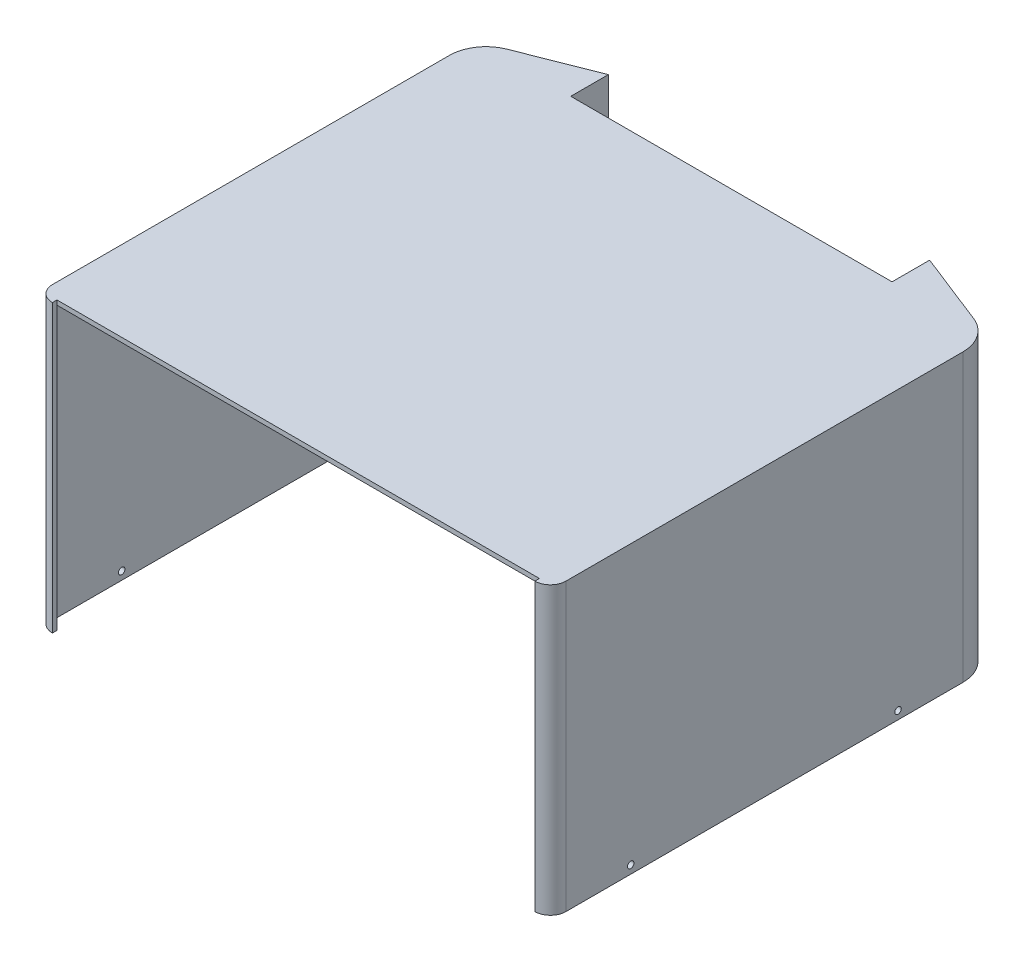
ISO-10303-21;
HEADER;
FILE_DESCRIPTION(('STEP AP214'),'2;1');
FILE_NAME('part.step','',(''),(''),'','','');
FILE_SCHEMA(('AUTOMOTIVE_DESIGN { 1 0 10303 214 1 1 1 1 }'));
ENDSEC;
DATA;
#1=APPLICATION_CONTEXT('core data for automotive mechanical design processes');
#2=APPLICATION_PROTOCOL_DEFINITION('international standard','automotive_design',2000,#1);
#3=PRODUCT_CONTEXT('',#1,'mechanical');
#4=PRODUCT('Part','Part','',(#3));
#5=PRODUCT_RELATED_PRODUCT_CATEGORY('part','',(#4));
#6=PRODUCT_DEFINITION_FORMATION('','',#4);
#7=PRODUCT_DEFINITION_CONTEXT('part definition',#1,'design');
#8=PRODUCT_DEFINITION('design','',#6,#7);
#9=PRODUCT_DEFINITION_SHAPE('','',#8);
#10=(LENGTH_UNIT() NAMED_UNIT(*) SI_UNIT(.MILLI.,.METRE.));
#11=(NAMED_UNIT(*) PLANE_ANGLE_UNIT() SI_UNIT($,.RADIAN.));
#12=(NAMED_UNIT(*) SI_UNIT($,.STERADIAN.) SOLID_ANGLE_UNIT());
#13=UNCERTAINTY_MEASURE_WITH_UNIT(LENGTH_MEASURE(1.E-05),#10,'distance_accuracy_value','');
#14=(GEOMETRIC_REPRESENTATION_CONTEXT(3) GLOBAL_UNCERTAINTY_ASSIGNED_CONTEXT((#13)) GLOBAL_UNIT_ASSIGNED_CONTEXT((#10,
#11,#12)) REPRESENTATION_CONTEXT('',''));
#15=CARTESIAN_POINT('',(0.,0.,0.));
#16=DIRECTION('',(0.,0.,1.));
#17=DIRECTION('',(1.,0.,0.));
#18=AXIS2_PLACEMENT_3D('',#15,#16,#17);
#19=CARTESIAN_POINT('',(-50.0594055574218,82.,0.));
#20=DIRECTION('',(-1.,0.,0.));
#21=DIRECTION('',(0.,0.,1.));
#22=AXIS2_PLACEMENT_3D('',#19,#20,#21);
#23=PLANE('',#22);
#24=DIRECTION('',(0.,0.,1.));
#25=VECTOR('',#24,1.);
#26=CARTESIAN_POINT('',(-50.0594055574218,81.6600000000001,-61.0605386585292));
#27=LINE('',#26,#25);
#28=CARTESIAN_POINT('',(-50.0594055574218,81.6600000000001,-61.0605386585292));
#29=VERTEX_POINT('',#28);
#30=CARTESIAN_POINT('',(-50.0594055574218,81.6600000000001,-59.6605386585292));
#31=VERTEX_POINT('',#30);
#32=EDGE_CURVE('E417',#29,#31,#27,.T.);
#33=ORIENTED_EDGE('',*,*,#32,.T.);
#34=DIRECTION('',(0.,-1.,0.));
#35=VECTOR('',#34,1.);
#36=CARTESIAN_POINT('',(-50.0594055574218,96.9,-59.6605386585272));
#37=LINE('',#36,#35);
#38=CARTESIAN_POINT('',(-50.0594055574218,0.,-59.6605386585272));
#39=VERTEX_POINT('',#38);
#40=EDGE_CURVE('E46',#31,#39,#37,.T.);
#41=ORIENTED_EDGE('',*,*,#40,.T.);
#42=DIRECTION('',(0.,0.,-1.));
#43=VECTOR('',#42,1.);
#44=CARTESIAN_POINT('',(-50.0594055574218,0.,0.));
#45=LINE('',#44,#43);
#46=CARTESIAN_POINT('',(-50.0594055574218,0.,-72.6605386585272));
#47=VERTEX_POINT('',#46);
#48=EDGE_CURVE('E333',#39,#47,#45,.T.);
#49=ORIENTED_EDGE('',*,*,#48,.T.);
#50=DIRECTION('',(0.,-1.,0.));
#51=VECTOR('',#50,1.);
#52=CARTESIAN_POINT('',(-50.0594055574218,82.,-72.6605386585272));
#53=LINE('',#52,#51);
#54=CARTESIAN_POINT('',(-50.0594055574218,88.4,-72.6605386585272));
#55=VERTEX_POINT('',#54);
#56=EDGE_CURVE('E244',#55,#47,#53,.T.);
#57=ORIENTED_EDGE('',*,*,#56,.F.);
#58=DIRECTION('',(0.,0.,-1.));
#59=VECTOR('',#58,1.);
#60=CARTESIAN_POINT('',(-50.0594055574218,88.4,0.));
#61=LINE('',#60,#59);
#62=CARTESIAN_POINT('',(-50.0594055574218,88.4,-61.0605386585292));
#63=VERTEX_POINT('',#62);
#64=EDGE_CURVE('E226',#63,#55,#61,.T.);
#65=ORIENTED_EDGE('',*,*,#64,.F.);
#66=DIRECTION('',(0.,-1.,0.));
#67=VECTOR('',#66,1.);
#68=CARTESIAN_POINT('',(-50.0594055574218,0.,-61.0605386585292));
#69=LINE('',#68,#67);
#70=EDGE_CURVE('E233',#63,#29,#69,.T.);
#71=ORIENTED_EDGE('',*,*,#70,.T.);
#72=EDGE_LOOP('',(#33,#41,#49,#57,#65,#71));
#73=FACE_BOUND('',#72,.T.);
#74=ADVANCED_FACE('F42',(#73),#23,.F.);
#75=CARTESIAN_POINT('',(49.1720519476544,88.4,0.));
#76=DIRECTION('',(1.,0.,0.));
#77=DIRECTION('',(0.,0.,-1.));
#78=AXIS2_PLACEMENT_3D('',#75,#76,#77);
#79=PLANE('',#78);
#80=DIRECTION('',(0.,0.,1.));
#81=VECTOR('',#80,1.);
#82=CARTESIAN_POINT('',(49.1720519476541,81.66,-61.0605386585272));
#83=LINE('',#82,#81);
#84=CARTESIAN_POINT('',(49.1720519476541,81.66,-61.0605386585272));
#85=VERTEX_POINT('',#84);
#86=CARTESIAN_POINT('',(49.1720519476544,81.66,-59.6605386585272));
#87=VERTEX_POINT('',#86);
#88=EDGE_CURVE('E444',#85,#87,#83,.T.);
#89=ORIENTED_EDGE('',*,*,#88,.F.);
#90=DIRECTION('',(0.,-1.,0.));
#91=VECTOR('',#90,1.);
#92=CARTESIAN_POINT('',(49.1720519476509,-1.92367756039792E-12,-61.0605386585272));
#93=LINE('',#92,#91);
#94=CARTESIAN_POINT('',(49.1720519476544,88.4,-61.0605386585272));
#95=VERTEX_POINT('',#94);
#96=EDGE_CURVE('E232',#95,#85,#93,.T.);
#97=ORIENTED_EDGE('',*,*,#96,.F.);
#98=DIRECTION('',(0.,0.,1.));
#99=VECTOR('',#98,1.);
#100=CARTESIAN_POINT('',(49.1720519476544,88.4,0.));
#101=LINE('',#100,#99);
#102=CARTESIAN_POINT('',(49.1720519476544,88.4,-72.6605386585272));
#103=VERTEX_POINT('',#102);
#104=EDGE_CURVE('E229',#103,#95,#101,.T.);
#105=ORIENTED_EDGE('',*,*,#104,.F.);
#106=DIRECTION('',(0.,-1.,0.));
#107=VECTOR('',#106,1.);
#108=CARTESIAN_POINT('',(49.1720519476544,88.4,-72.6605386585272));
#109=LINE('',#108,#107);
#110=CARTESIAN_POINT('',(49.1720519476544,0.,-72.6605386585272));
#111=VERTEX_POINT('',#110);
#112=EDGE_CURVE('E281',#103,#111,#109,.T.);
#113=ORIENTED_EDGE('',*,*,#112,.T.);
#114=DIRECTION('',(0.,0.,-1.));
#115=VECTOR('',#114,1.);
#116=CARTESIAN_POINT('',(49.1720519476544,0.,0.));
#117=LINE('',#116,#115);
#118=CARTESIAN_POINT('',(49.1720519476544,0.,-59.6605386585272));
#119=VERTEX_POINT('',#118);
#120=EDGE_CURVE('E519',#119,#111,#117,.T.);
#121=ORIENTED_EDGE('',*,*,#120,.F.);
#122=DIRECTION('',(0.,-1.,0.));
#123=VECTOR('',#122,1.);
#124=CARTESIAN_POINT('',(49.1720519476544,82.,-59.6605386585272));
#125=LINE('',#124,#123);
#126=EDGE_CURVE('E541',#87,#119,#125,.T.);
#127=ORIENTED_EDGE('',*,*,#126,.F.);
#128=EDGE_LOOP('',(#89,#97,#105,#113,#121,#127));
#129=FACE_BOUND('',#128,.T.);
#130=ADVANCED_FACE('F484',(#129),#79,.F.);
#131=CARTESIAN_POINT('',(0.,87.,0.));
#132=DIRECTION('',(0.,1.,0.));
#133=DIRECTION('',(0.,0.,1.));
#134=AXIS2_PLACEMENT_3D('',#131,#132,#133);
#135=PLANE('',#134);
#136=DIRECTION('',(1.,0.,0.));
#137=VECTOR('',#136,1.);
#138=CARTESIAN_POINT('',(-51.4594055574218,87.,-59.6605386585272));
#139=LINE('',#138,#137);
#140=CARTESIAN_POINT('',(-51.4594055574218,87.,-59.6605386585272));
#141=VERTEX_POINT('',#140);
#142=CARTESIAN_POINT('',(50.5720519476544,87.,-59.6605386585272));
#143=VERTEX_POINT('',#142);
#144=EDGE_CURVE('E301',#141,#143,#139,.T.);
#145=ORIENTED_EDGE('',*,*,#144,.T.);
#146=DIRECTION('',(0.,0.,-1.));
#147=VECTOR('',#146,1.);
#148=CARTESIAN_POINT('',(50.5720519476544,87.,-59.6605386585272));
#149=LINE('',#148,#147);
#150=CARTESIAN_POINT('',(50.5720519476544,87.,-70.6049959841991));
#151=VERTEX_POINT('',#150);
#152=EDGE_CURVE('E443',#143,#151,#149,.T.);
#153=ORIENTED_EDGE('',*,*,#152,.T.);
#154=DIRECTION('',(0.930522484488547,0.,0.366234768777162));
#155=VECTOR('',#154,1.);
#156=CARTESIAN_POINT('',(50.5720519476544,87.,-70.6049959841991));
#157=LINE('',#156,#155);
#158=CARTESIAN_POINT('',(71.1186708828879,87.,-62.5182636802143));
#159=VERTEX_POINT('',#158);
#160=EDGE_CURVE('E494',#151,#159,#157,.T.);
#161=ORIENTED_EDGE('',*,*,#160,.T.);
#162=CARTESIAN_POINT('',(67.4563231951163,87.,-53.2130388353289));
#163=DIRECTION('',(0.,-1.,0.));
#164=DIRECTION('',(0.,0.,1.));
#165=AXIS2_PLACEMENT_3D('',#162,#163,#164);
#166=CIRCLE('',#165,9.99999999999996);
#167=CARTESIAN_POINT('',(77.4563231951162,87.,-53.2130388353289));
#168=VERTEX_POINT('',#167);
#169=EDGE_CURVE('E497',#159,#168,#166,.T.);
#170=ORIENTED_EDGE('',*,*,#169,.T.);
#171=DIRECTION('',(0.,0.,1.));
#172=VECTOR('',#171,1.);
#173=CARTESIAN_POINT('',(77.4563231951162,87.,-53.2130388353289));
#174=LINE('',#173,#172);
#175=CARTESIAN_POINT('',(77.4563231951163,87.,69.3394613414728));
#176=VERTEX_POINT('',#175);
#177=EDGE_CURVE('E441',#168,#176,#174,.T.);
#178=ORIENTED_EDGE('',*,*,#177,.T.);
#179=CARTESIAN_POINT('',(74.0563231951163,87.,69.3394613414728));
#180=DIRECTION('',(0.,-1.,0.));
#181=DIRECTION('',(0.,0.,1.));
#182=AXIS2_PLACEMENT_3D('',#179,#180,#181);
#183=CIRCLE('',#182,3.39999999999999);
#184=CARTESIAN_POINT('',(74.0563231951163,87.,72.7394613414728));
#185=VERTEX_POINT('',#184);
#186=EDGE_CURVE('E438',#176,#185,#183,.T.);
#187=ORIENTED_EDGE('',*,*,#186,.T.);
#188=DIRECTION('',(-1.,0.,0.));
#189=VECTOR('',#188,1.);
#190=CARTESIAN_POINT('',(0.,87.,72.7394613414728));
#191=LINE('',#190,#189);
#192=CARTESIAN_POINT('',(-74.9436768048837,87.,72.7394613414728));
#193=VERTEX_POINT('',#192);
#194=EDGE_CURVE('E247',#185,#193,#191,.T.);
#195=ORIENTED_EDGE('',*,*,#194,.T.);
#196=CARTESIAN_POINT('',(-74.9436768048837,87.,69.3394613414728));
#197=DIRECTION('',(0.,-1.,0.));
#198=DIRECTION('',(0.,0.,1.));
#199=AXIS2_PLACEMENT_3D('',#196,#197,#198);
#200=CIRCLE('',#199,3.4);
#201=CARTESIAN_POINT('',(-78.3436768048837,87.,69.3394613414728));
#202=VERTEX_POINT('',#201);
#203=EDGE_CURVE('E303',#193,#202,#200,.T.);
#204=ORIENTED_EDGE('',*,*,#203,.T.);
#205=DIRECTION('',(0.,0.,-1.));
#206=VECTOR('',#205,1.);
#207=CARTESIAN_POINT('',(-78.3436768048837,87.,69.3394613414728));
#208=LINE('',#207,#206);
#209=CARTESIAN_POINT('',(-78.3436768048837,87.,-53.2130388353288));
#210=VERTEX_POINT('',#209);
#211=EDGE_CURVE('E306',#202,#210,#208,.T.);
#212=ORIENTED_EDGE('',*,*,#211,.T.);
#213=CARTESIAN_POINT('',(-68.3436768048837,87.,-53.2130388353289));
#214=DIRECTION('',(0.,-1.,0.));
#215=DIRECTION('',(0.,0.,1.));
#216=AXIS2_PLACEMENT_3D('',#213,#214,#215);
#217=CIRCLE('',#216,10.);
#218=CARTESIAN_POINT('',(-72.0060244926553,87.,-62.5182636802143));
#219=VERTEX_POINT('',#218);
#220=EDGE_CURVE('E309',#210,#219,#217,.T.);
#221=ORIENTED_EDGE('',*,*,#220,.T.);
#222=DIRECTION('',(0.930522484488548,0.,-0.36623476877716));
#223=VECTOR('',#222,1.);
#224=CARTESIAN_POINT('',(-72.0060244926553,87.,-62.5182636802143));
#225=LINE('',#224,#223);
#226=CARTESIAN_POINT('',(-51.4594055574218,87.,-70.6049959841991));
#227=VERTEX_POINT('',#226);
#228=EDGE_CURVE('E312',#219,#227,#225,.T.);
#229=ORIENTED_EDGE('',*,*,#228,.T.);
#230=DIRECTION('',(0.,0.,1.));
#231=VECTOR('',#230,1.);
#232=CARTESIAN_POINT('',(-51.4594055574218,87.,-70.6049959841991));
#233=LINE('',#232,#231);
#234=EDGE_CURVE('E298',#227,#141,#233,.T.);
#235=ORIENTED_EDGE('',*,*,#234,.T.);
#236=EDGE_LOOP('',(#145,#153,#161,#170,#178,#187,#195,#204,#212,#221,#229,#235));
#237=FACE_BOUND('',#236,.T.);
#238=ADVANCED_FACE('F434',(#237),#135,.F.);
#239=CARTESIAN_POINT('',(0.,0.,0.));
#240=DIRECTION('',(0.,1.,0.));
#241=DIRECTION('',(0.,0.,1.));
#242=AXIS2_PLACEMENT_3D('',#239,#240,#241);
#243=PLANE('',#242);
#244=CARTESIAN_POINT('',(-74.9436768048837,0.,69.3394613414728));
#245=DIRECTION('',(0.,1.,0.));
#246=DIRECTION('',(0.,0.,1.));
#247=AXIS2_PLACEMENT_3D('',#244,#245,#246);
#248=CIRCLE('',#247,3.4);
#249=CARTESIAN_POINT('',(-78.3436768048837,0.,69.3394613414728));
#250=VERTEX_POINT('',#249);
#251=CARTESIAN_POINT('',(-74.9436768048837,0.,72.7394613414728));
#252=VERTEX_POINT('',#251);
#253=EDGE_CURVE('E315',#250,#252,#248,.T.);
#254=ORIENTED_EDGE('',*,*,#253,.T.);
#255=DIRECTION('',(0.,0.,1.));
#256=VECTOR('',#255,1.);
#257=CARTESIAN_POINT('',(-74.9436768048837,0.,72.6394613414728));
#258=LINE('',#257,#256);
#259=CARTESIAN_POINT('',(-74.9436768048837,0.,74.1394613414728));
#260=VERTEX_POINT('',#259);
#261=EDGE_CURVE('E67',#252,#260,#258,.T.);
#262=ORIENTED_EDGE('',*,*,#261,.T.);
#263=CARTESIAN_POINT('',(-74.9436768048837,0.,69.3394613414728));
#264=DIRECTION('',(0.,1.,0.));
#265=DIRECTION('',(0.,0.,1.));
#266=AXIS2_PLACEMENT_3D('',#263,#264,#265);
#267=CIRCLE('',#266,4.8);
#268=CARTESIAN_POINT('',(-79.7436768048837,0.,69.3394613414728));
#269=VERTEX_POINT('',#268);
#270=EDGE_CURVE('E338',#269,#260,#267,.T.);
#271=ORIENTED_EDGE('',*,*,#270,.F.);
#272=DIRECTION('',(0.,0.,1.));
#273=VECTOR('',#272,1.);
#274=CARTESIAN_POINT('',(-79.7436768048837,0.,0.));
#275=LINE('',#274,#273);
#276=CARTESIAN_POINT('',(-79.7436768048837,0.,-53.2130388353288));
#277=VERTEX_POINT('',#276);
#278=EDGE_CURVE('E335',#277,#269,#275,.T.);
#279=ORIENTED_EDGE('',*,*,#278,.F.);
#280=CARTESIAN_POINT('',(-68.3436768048837,0.,-53.2130388353289));
#281=DIRECTION('',(0.,1.,0.));
#282=DIRECTION('',(0.,0.,1.));
#283=AXIS2_PLACEMENT_3D('',#280,#281,#282);
#284=CIRCLE('',#283,11.4);
#285=CARTESIAN_POINT('',(-72.5187531689433,0.,-63.8209951584983));
#286=VERTEX_POINT('',#285);
#287=EDGE_CURVE('E348',#277,#286,#284,.F.);
#288=ORIENTED_EDGE('',*,*,#287,.T.);
#289=DIRECTION('',(0.930522484488547,0.,-0.366234768777162));
#290=VECTOR('',#289,1.);
#291=CARTESIAN_POINT('',(-31.4763254590337,0.,-79.9744619182552));
#292=LINE('',#291,#290);
#293=EDGE_CURVE('E351',#286,#47,#292,.T.);
#294=ORIENTED_EDGE('',*,*,#293,.T.);
#295=ORIENTED_EDGE('',*,*,#48,.F.);
#296=DIRECTION('',(-1.,0.,0.));
#297=VECTOR('',#296,1.);
#298=CARTESIAN_POINT('',(0.,0.,-59.6605386585272));
#299=LINE('',#298,#297);
#300=CARTESIAN_POINT('',(-51.4594055574218,0.,-59.6605386585272));
#301=VERTEX_POINT('',#300);
#302=EDGE_CURVE('E354',#39,#301,#299,.T.);
#303=ORIENTED_EDGE('',*,*,#302,.T.);
#304=DIRECTION('',(0.,0.,-1.));
#305=VECTOR('',#304,1.);
#306=CARTESIAN_POINT('',(-51.4594055574218,0.,0.));
#307=LINE('',#306,#305);
#308=CARTESIAN_POINT('',(-51.4594055574218,0.,-70.6049959841991));
#309=VERTEX_POINT('',#308);
#310=EDGE_CURVE('E358',#301,#309,#307,.T.);
#311=ORIENTED_EDGE('',*,*,#310,.T.);
#312=DIRECTION('',(0.930522484488547,0.,-0.366234768777162));
#313=VECTOR('',#312,1.);
#314=CARTESIAN_POINT('',(-30.9635967827457,0.,-78.6717304399712));
#315=LINE('',#314,#313);
#316=CARTESIAN_POINT('',(-72.0060244926553,0.,-62.5182636802143));
#317=VERTEX_POINT('',#316);
#318=EDGE_CURVE('E326',#317,#309,#315,.T.);
#319=ORIENTED_EDGE('',*,*,#318,.F.);
#320=CARTESIAN_POINT('',(-68.3436768048837,0.,-53.2130388353289));
#321=DIRECTION('',(0.,1.,0.));
#322=DIRECTION('',(0.,0.,1.));
#323=AXIS2_PLACEMENT_3D('',#320,#321,#322);
#324=CIRCLE('',#323,9.99999999999998);
#325=CARTESIAN_POINT('',(-78.3436768048837,0.,-53.2130388353288));
#326=VERTEX_POINT('',#325);
#327=EDGE_CURVE('E323',#326,#317,#324,.F.);
#328=ORIENTED_EDGE('',*,*,#327,.F.);
#329=DIRECTION('',(0.,0.,1.));
#330=VECTOR('',#329,1.);
#331=CARTESIAN_POINT('',(-78.3436768048837,0.,0.));
#332=LINE('',#331,#330);
#333=EDGE_CURVE('E319',#326,#250,#332,.T.);
#334=ORIENTED_EDGE('',*,*,#333,.T.);
#335=EDGE_LOOP('',(#254,#262,#271,#279,#288,#294,#295,#303,#311,#319,#328,#334));
#336=FACE_BOUND('',#335,.T.);
#337=ADVANCED_FACE('F44',(#336),#243,.F.);
#338=CARTESIAN_POINT('',(-74.9436768048837,82.,69.3394613414728));
#339=DIRECTION('',(0.,-1.,0.));
#340=DIRECTION('',(0.,0.,-1.));
#341=AXIS2_PLACEMENT_3D('',#338,#339,#340);
#342=CYLINDRICAL_SURFACE('',#341,3.4);
#343=DIRECTION('',(0.,-1.,0.));
#344=VECTOR('',#343,1.);
#345=CARTESIAN_POINT('',(-78.3436768048837,82.,69.3394613414728));
#346=LINE('',#345,#344);
#347=EDGE_CURVE('E318',#202,#250,#346,.T.);
#348=ORIENTED_EDGE('',*,*,#347,.F.);
#349=ORIENTED_EDGE('',*,*,#203,.F.);
#350=DIRECTION('',(0.,-1.,0.));
#351=VECTOR('',#350,1.);
#352=CARTESIAN_POINT('',(-74.9436768048837,82.,72.7394613414728));
#353=LINE('',#352,#351);
#354=EDGE_CURVE('E316',#193,#252,#353,.T.);
#355=ORIENTED_EDGE('',*,*,#354,.T.);
#356=ORIENTED_EDGE('',*,*,#253,.F.);
#357=EDGE_LOOP('',(#348,#349,#355,#356));
#358=FACE_BOUND('',#357,.T.);
#359=ADVANCED_FACE('F398',(#358),#342,.F.);
#360=CARTESIAN_POINT('',(-78.3436768048837,82.,0.));
#361=DIRECTION('',(1.,0.,0.));
#362=DIRECTION('',(0.,0.,-1.));
#363=AXIS2_PLACEMENT_3D('',#360,#361,#362);
#364=PLANE('',#363);
#365=CARTESIAN_POINT('',(-78.3436768048837,2.5,-33.2130388353288));
#366=DIRECTION('',(1.,0.,0.));
#367=DIRECTION('',(0.,0.,-1.));
#368=AXIS2_PLACEMENT_3D('',#365,#366,#367);
#369=CIRCLE('',#368,0.999999999999998);
#370=CARTESIAN_POINT('',(-78.3436768048837,2.5,-34.2130388353288));
#371=VERTEX_POINT('',#370);
#372=EDGE_CURVE('E51',#371,#371,#369,.T.);
#373=ORIENTED_EDGE('',*,*,#372,.F.);
#374=EDGE_LOOP('',(#373));
#375=FACE_BOUND('',#374,.T.);
#376=CARTESIAN_POINT('',(-78.3436768048837,2.5,49.3394613414728));
#377=DIRECTION('',(1.,0.,0.));
#378=DIRECTION('',(0.,0.,-1.));
#379=AXIS2_PLACEMENT_3D('',#376,#377,#378);
#380=CIRCLE('',#379,0.999999999999998);
#381=CARTESIAN_POINT('',(-78.3436768048837,2.5,48.3394613414728));
#382=VERTEX_POINT('',#381);
#383=EDGE_CURVE('E344',#382,#382,#380,.T.);
#384=ORIENTED_EDGE('',*,*,#383,.F.);
#385=EDGE_LOOP('',(#384));
#386=FACE_BOUND('',#385,.T.);
#387=DIRECTION('',(0.,-1.,0.));
#388=VECTOR('',#387,1.);
#389=CARTESIAN_POINT('',(-78.3436768048837,82.,-53.2130388353288));
#390=LINE('',#389,#388);
#391=EDGE_CURVE('E321',#210,#326,#390,.T.);
#392=ORIENTED_EDGE('',*,*,#391,.F.);
#393=ORIENTED_EDGE('',*,*,#211,.F.);
#394=ORIENTED_EDGE('',*,*,#347,.T.);
#395=ORIENTED_EDGE('',*,*,#333,.F.);
#396=EDGE_LOOP('',(#392,#393,#394,#395));
#397=FACE_BOUND('',#396,.T.);
#398=ADVANCED_FACE('F432',(#375,#386,#397),#364,.T.);
#399=CARTESIAN_POINT('',(-68.3436768048837,82.,-53.2130388353289));
#400=DIRECTION('',(0.,-1.,0.));
#401=DIRECTION('',(0.,0.,-1.));
#402=AXIS2_PLACEMENT_3D('',#399,#400,#401);
#403=CYLINDRICAL_SURFACE('',#402,9.99999999999998);
#404=DIRECTION('',(0.,-1.,0.));
#405=VECTOR('',#404,1.);
#406=CARTESIAN_POINT('',(-72.0060244926553,82.,-62.5182636802143));
#407=LINE('',#406,#405);
#408=EDGE_CURVE('E324',#219,#317,#407,.T.);
#409=ORIENTED_EDGE('',*,*,#408,.F.);
#410=ORIENTED_EDGE('',*,*,#220,.F.);
#411=ORIENTED_EDGE('',*,*,#391,.T.);
#412=ORIENTED_EDGE('',*,*,#327,.T.);
#413=EDGE_LOOP('',(#409,#410,#411,#412));
#414=FACE_BOUND('',#413,.T.);
#415=ADVANCED_FACE('F430',(#414),#403,.F.);
#416=CARTESIAN_POINT('',(-30.9635967827457,82.,-78.6717304399712));
#417=DIRECTION('',(-0.366234768777162,0.,-0.930522484488547));
#418=DIRECTION('',(-0.930522484488547,0.,0.366234768777162));
#419=AXIS2_PLACEMENT_3D('',#416,#417,#418);
#420=PLANE('',#419);
#421=DIRECTION('',(0.,-1.,0.));
#422=VECTOR('',#421,1.);
#423=CARTESIAN_POINT('',(-51.4594055574218,82.,-70.6049959841991));
#424=LINE('',#423,#422);
#425=EDGE_CURVE('E327',#227,#309,#424,.T.);
#426=ORIENTED_EDGE('',*,*,#425,.F.);
#427=ORIENTED_EDGE('',*,*,#228,.F.);
#428=ORIENTED_EDGE('',*,*,#408,.T.);
#429=ORIENTED_EDGE('',*,*,#318,.T.);
#430=EDGE_LOOP('',(#426,#427,#428,#429));
#431=FACE_BOUND('',#430,.T.);
#432=ADVANCED_FACE('F427',(#431),#420,.F.);
#433=CARTESIAN_POINT('',(-51.4594055574218,82.,0.));
#434=DIRECTION('',(-1.,0.,0.));
#435=DIRECTION('',(0.,0.,1.));
#436=AXIS2_PLACEMENT_3D('',#433,#434,#435);
#437=PLANE('',#436);
#438=DIRECTION('',(0.,-1.,0.));
#439=VECTOR('',#438,1.);
#440=CARTESIAN_POINT('',(-51.4594055574218,82.,-59.6605386585272));
#441=LINE('',#440,#439);
#442=EDGE_CURVE('E329',#141,#301,#441,.T.);
#443=ORIENTED_EDGE('',*,*,#442,.F.);
#444=ORIENTED_EDGE('',*,*,#234,.F.);
#445=ORIENTED_EDGE('',*,*,#425,.T.);
#446=ORIENTED_EDGE('',*,*,#310,.F.);
#447=EDGE_LOOP('',(#443,#444,#445,#446));
#448=FACE_BOUND('',#447,.T.);
#449=ADVANCED_FACE('F423',(#448),#437,.T.);
#450=CARTESIAN_POINT('',(0.,82.,-59.6605386585272));
#451=DIRECTION('',(0.,0.,1.));
#452=DIRECTION('',(1.,0.,0.));
#453=AXIS2_PLACEMENT_3D('',#450,#451,#452);
#454=PLANE('',#453);
#455=ORIENTED_EDGE('',*,*,#302,.F.);
#456=ORIENTED_EDGE('',*,*,#40,.F.);
#457=DIRECTION('',(-1.,0.,0.));
#458=VECTOR('',#457,1.);
#459=CARTESIAN_POINT('',(1.21471754603014E-12,81.66,-59.6605386585282));
#460=LINE('',#459,#458);
#461=EDGE_CURVE('E58',#87,#31,#460,.T.);
#462=ORIENTED_EDGE('',*,*,#461,.F.);
#463=ORIENTED_EDGE('',*,*,#126,.T.);
#464=DIRECTION('',(1.,0.,0.));
#465=VECTOR('',#464,1.);
#466=CARTESIAN_POINT('',(0.,0.,-59.6605386585272));
#467=LINE('',#466,#465);
#468=CARTESIAN_POINT('',(50.5720519476544,0.,-59.6605386585272));
#469=VERTEX_POINT('',#468);
#470=EDGE_CURVE('E521',#119,#469,#467,.T.);
#471=ORIENTED_EDGE('',*,*,#470,.T.);
#472=DIRECTION('',(0.,-1.,0.));
#473=VECTOR('',#472,1.);
#474=CARTESIAN_POINT('',(50.5720519476544,82.,-59.6605386585272));
#475=LINE('',#474,#473);
#476=EDGE_CURVE('E539',#143,#469,#475,.T.);
#477=ORIENTED_EDGE('',*,*,#476,.F.);
#478=ORIENTED_EDGE('',*,*,#144,.F.);
#479=ORIENTED_EDGE('',*,*,#442,.T.);
#480=EDGE_LOOP('',(#455,#456,#462,#463,#471,#477,#478,#479));
#481=FACE_BOUND('',#480,.T.);
#482=ADVANCED_FACE('F418',(#481),#454,.T.);
#483=CARTESIAN_POINT('',(-31.4763254590337,82.,-79.9744619182552));
#484=DIRECTION('',(-0.366234768777162,0.,-0.930522484488547));
#485=DIRECTION('',(-0.930522484488547,0.,0.366234768777162));
#486=AXIS2_PLACEMENT_3D('',#483,#484,#485);
#487=PLANE('',#486);
#488=ORIENTED_EDGE('',*,*,#293,.F.);
#489=DIRECTION('',(0.,-1.,0.));
#490=VECTOR('',#489,1.);
#491=CARTESIAN_POINT('',(-72.5187531689433,82.,-63.8209951584983));
#492=LINE('',#491,#490);
#493=CARTESIAN_POINT('',(-72.5187531689434,88.4,-63.8209951584983));
#494=VERTEX_POINT('',#493);
#495=EDGE_CURVE('E332',#494,#286,#492,.T.);
#496=ORIENTED_EDGE('',*,*,#495,.F.);
#497=DIRECTION('',(-0.930522484488547,0.,0.366234768777162));
#498=VECTOR('',#497,1.);
#499=CARTESIAN_POINT('',(-31.4763254590337,88.4,-79.9744619182552));
#500=LINE('',#499,#498);
#501=EDGE_CURVE('E246',#55,#494,#500,.T.);
#502=ORIENTED_EDGE('',*,*,#501,.F.);
#503=ORIENTED_EDGE('',*,*,#56,.T.);
#504=EDGE_LOOP('',(#488,#496,#502,#503));
#505=FACE_BOUND('',#504,.T.);
#506=ADVANCED_FACE('F416',(#505),#487,.T.);
#507=CARTESIAN_POINT('',(-68.3436768048837,82.,-53.2130388353289));
#508=DIRECTION('',(0.,-1.,0.));
#509=DIRECTION('',(0.,0.,-1.));
#510=AXIS2_PLACEMENT_3D('',#507,#508,#509);
#511=CYLINDRICAL_SURFACE('',#510,11.4);
#512=ORIENTED_EDGE('',*,*,#287,.F.);
#513=DIRECTION('',(0.,-1.,0.));
#514=VECTOR('',#513,1.);
#515=CARTESIAN_POINT('',(-79.7436768048837,82.,-53.2130388353288));
#516=LINE('',#515,#514);
#517=CARTESIAN_POINT('',(-79.7436768048837,88.4,-53.2130388353288));
#518=VERTEX_POINT('',#517);
#519=EDGE_CURVE('E336',#518,#277,#516,.T.);
#520=ORIENTED_EDGE('',*,*,#519,.F.);
#521=CARTESIAN_POINT('',(-68.3436768048837,88.4,-53.2130388353289));
#522=DIRECTION('',(0.,1.,0.));
#523=DIRECTION('',(0.,0.,1.));
#524=AXIS2_PLACEMENT_3D('',#521,#522,#523);
#525=CIRCLE('',#524,11.4);
#526=EDGE_CURVE('E249',#494,#518,#525,.T.);
#527=ORIENTED_EDGE('',*,*,#526,.F.);
#528=ORIENTED_EDGE('',*,*,#495,.T.);
#529=EDGE_LOOP('',(#512,#520,#527,#528));
#530=FACE_BOUND('',#529,.T.);
#531=ADVANCED_FACE('F384',(#530),#511,.T.);
#532=CARTESIAN_POINT('',(-79.7436768048837,82.,0.));
#533=DIRECTION('',(1.,0.,0.));
#534=DIRECTION('',(0.,0.,-1.));
#535=AXIS2_PLACEMENT_3D('',#532,#533,#534);
#536=PLANE('',#535);
#537=CARTESIAN_POINT('',(-79.7436768048837,2.5,-33.2130388353288));
#538=DIRECTION('',(-1.,0.,0.));
#539=DIRECTION('',(0.,0.,1.));
#540=AXIS2_PLACEMENT_3D('',#537,#538,#539);
#541=CIRCLE('',#540,0.999999999999998);
#542=CARTESIAN_POINT('',(-79.7436768048837,2.5,-32.2130388353288));
#543=VERTEX_POINT('',#542);
#544=EDGE_CURVE('E11',#543,#543,#541,.T.);
#545=ORIENTED_EDGE('',*,*,#544,.F.);
#546=EDGE_LOOP('',(#545));
#547=FACE_BOUND('',#546,.T.);
#548=CARTESIAN_POINT('',(-79.7436768048837,2.5,49.3394613414728));
#549=DIRECTION('',(-1.,0.,0.));
#550=DIRECTION('',(0.,0.,1.));
#551=AXIS2_PLACEMENT_3D('',#548,#549,#550);
#552=CIRCLE('',#551,0.999999999999998);
#553=CARTESIAN_POINT('',(-79.7436768048837,2.5,50.3394613414728));
#554=VERTEX_POINT('',#553);
#555=EDGE_CURVE('E372',#554,#554,#552,.T.);
#556=ORIENTED_EDGE('',*,*,#555,.F.);
#557=EDGE_LOOP('',(#556));
#558=FACE_BOUND('',#557,.T.);
#559=ORIENTED_EDGE('',*,*,#278,.T.);
#560=DIRECTION('',(0.,-1.,0.));
#561=VECTOR('',#560,1.);
#562=CARTESIAN_POINT('',(-79.7436768048837,82.,69.3394613414728));
#563=LINE('',#562,#561);
#564=CARTESIAN_POINT('',(-79.7436768048837,88.4,69.3394613414728));
#565=VERTEX_POINT('',#564);
#566=EDGE_CURVE('E339',#565,#269,#563,.T.);
#567=ORIENTED_EDGE('',*,*,#566,.F.);
#568=DIRECTION('',(0.,0.,1.));
#569=VECTOR('',#568,1.);
#570=CARTESIAN_POINT('',(-79.7436768048837,88.4,0.));
#571=LINE('',#570,#569);
#572=EDGE_CURVE('E260',#518,#565,#571,.T.);
#573=ORIENTED_EDGE('',*,*,#572,.F.);
#574=ORIENTED_EDGE('',*,*,#519,.T.);
#575=EDGE_LOOP('',(#559,#567,#573,#574));
#576=FACE_BOUND('',#575,.T.);
#577=ADVANCED_FACE('F380',(#547,#558,#576),#536,.F.);
#578=CARTESIAN_POINT('',(-74.9436768048837,82.,69.3394613414728));
#579=DIRECTION('',(0.,-1.,0.));
#580=DIRECTION('',(0.,0.,-1.));
#581=AXIS2_PLACEMENT_3D('',#578,#579,#580);
#582=CYLINDRICAL_SURFACE('',#581,4.8);
#583=ORIENTED_EDGE('',*,*,#270,.T.);
#584=DIRECTION('',(0.,-1.,0.));
#585=VECTOR('',#584,1.);
#586=CARTESIAN_POINT('',(-74.9436768048837,82.,74.1394613414728));
#587=LINE('',#586,#585);
#588=CARTESIAN_POINT('',(-74.9436768048837,88.4,74.1394613414728));
#589=VERTEX_POINT('',#588);
#590=EDGE_CURVE('E342',#589,#260,#587,.T.);
#591=ORIENTED_EDGE('',*,*,#590,.F.);
#592=CARTESIAN_POINT('',(-74.9436768048837,88.4,69.3394613414728));
#593=DIRECTION('',(0.,1.,0.));
#594=DIRECTION('',(0.,0.,1.));
#595=AXIS2_PLACEMENT_3D('',#592,#593,#594);
#596=CIRCLE('',#595,4.80000000000001);
#597=EDGE_CURVE('E263',#565,#589,#596,.T.);
#598=ORIENTED_EDGE('',*,*,#597,.F.);
#599=ORIENTED_EDGE('',*,*,#566,.T.);
#600=EDGE_LOOP('',(#583,#591,#598,#599));
#601=FACE_BOUND('',#600,.T.);
#602=ADVANCED_FACE('F383',(#601),#582,.T.);
#603=CARTESIAN_POINT('',(-74.9436768048837,82.,72.6394613414728));
#604=DIRECTION('',(-1.,0.,0.));
#605=DIRECTION('',(0.,0.,1.));
#606=AXIS2_PLACEMENT_3D('',#603,#604,#605);
#607=PLANE('',#606);
#608=ORIENTED_EDGE('',*,*,#354,.F.);
#609=DIRECTION('',(0.,-1.,0.));
#610=VECTOR('',#609,1.);
#611=CARTESIAN_POINT('',(-74.9436768048837,88.4,72.7394613414728));
#612=LINE('',#611,#610);
#613=CARTESIAN_POINT('',(-74.9436768048837,88.4,72.7394613414728));
#614=VERTEX_POINT('',#613);
#615=EDGE_CURVE('E295',#614,#193,#612,.T.);
#616=ORIENTED_EDGE('',*,*,#615,.F.);
#617=DIRECTION('',(0.,0.,-1.));
#618=VECTOR('',#617,1.);
#619=CARTESIAN_POINT('',(-74.9436768048837,88.4,0.));
#620=LINE('',#619,#618);
#621=EDGE_CURVE('E266',#589,#614,#620,.T.);
#622=ORIENTED_EDGE('',*,*,#621,.F.);
#623=ORIENTED_EDGE('',*,*,#590,.T.);
#624=ORIENTED_EDGE('',*,*,#261,.F.);
#625=EDGE_LOOP('',(#608,#616,#622,#623,#624));
#626=FACE_BOUND('',#625,.T.);
#627=ADVANCED_FACE('F402',(#626),#607,.F.);
#628=CARTESIAN_POINT('',(163.256323195116,2.5,49.3394613414728));
#629=DIRECTION('',(-1.,0.,0.));
#630=DIRECTION('',(0.,0.,1.));
#631=AXIS2_PLACEMENT_3D('',#628,#629,#630);
#632=CYLINDRICAL_SURFACE('',#631,0.999999999999998);
#633=ORIENTED_EDGE('',*,*,#383,.T.);
#634=EDGE_LOOP('',(#633));
#635=FACE_BOUND('',#634,.T.);
#636=ORIENTED_EDGE('',*,*,#555,.T.);
#637=EDGE_LOOP('',(#636));
#638=FACE_BOUND('',#637,.T.);
#639=ADVANCED_FACE('F378',(#635,#638),#632,.F.);
#640=CARTESIAN_POINT('',(163.256323195116,2.5,-33.2130388353288));
#641=DIRECTION('',(-1.,0.,0.));
#642=DIRECTION('',(0.,0.,1.));
#643=AXIS2_PLACEMENT_3D('',#640,#641,#642);
#644=CYLINDRICAL_SURFACE('',#643,0.999999999999998);
#645=ORIENTED_EDGE('',*,*,#372,.T.);
#646=EDGE_LOOP('',(#645));
#647=FACE_BOUND('',#646,.T.);
#648=ORIENTED_EDGE('',*,*,#544,.T.);
#649=EDGE_LOOP('',(#648));
#650=FACE_BOUND('',#649,.T.);
#651=ADVANCED_FACE('F576',(#647,#650),#644,.F.);
#652=CARTESIAN_POINT('',(0.,88.4,72.7394613414728));
#653=DIRECTION('',(0.,0.,1.));
#654=DIRECTION('',(1.,0.,0.));
#655=AXIS2_PLACEMENT_3D('',#652,#653,#654);
#656=PLANE('',#655);
#657=ORIENTED_EDGE('',*,*,#194,.F.);
#658=DIRECTION('',(0.,-1.,0.));
#659=VECTOR('',#658,1.);
#660=CARTESIAN_POINT('',(74.0563231951163,88.4,72.7394613414728));
#661=LINE('',#660,#659);
#662=CARTESIAN_POINT('',(74.0563231951163,88.4,72.7394613414728));
#663=VERTEX_POINT('',#662);
#664=EDGE_CURVE('E292',#663,#185,#661,.T.);
#665=ORIENTED_EDGE('',*,*,#664,.F.);
#666=DIRECTION('',(-1.,0.,0.));
#667=VECTOR('',#666,1.);
#668=CARTESIAN_POINT('',(0.,88.4,72.7394613414728));
#669=LINE('',#668,#667);
#670=EDGE_CURVE('E268',#663,#614,#669,.T.);
#671=ORIENTED_EDGE('',*,*,#670,.T.);
#672=ORIENTED_EDGE('',*,*,#615,.T.);
#673=EDGE_LOOP('',(#657,#665,#671,#672));
#674=FACE_BOUND('',#673,.T.);
#675=ADVANCED_FACE('F407',(#674),#656,.T.);
#676=CARTESIAN_POINT('',(74.0563231951163,88.4,0.));
#677=DIRECTION('',(1.,0.,0.));
#678=DIRECTION('',(0.,0.,-1.));
#679=AXIS2_PLACEMENT_3D('',#676,#677,#678);
#680=PLANE('',#679);
#681=ORIENTED_EDGE('',*,*,#664,.T.);
#682=DIRECTION('',(0.,-1.,0.));
#683=VECTOR('',#682,1.);
#684=CARTESIAN_POINT('',(74.0563231951163,82.,72.7394613414728));
#685=LINE('',#684,#683);
#686=CARTESIAN_POINT('',(74.0563231951163,0.,72.7394613414728));
#687=VERTEX_POINT('',#686);
#688=EDGE_CURVE('E449',#185,#687,#685,.T.);
#689=ORIENTED_EDGE('',*,*,#688,.T.);
#690=DIRECTION('',(0.,0.,1.));
#691=VECTOR('',#690,1.);
#692=CARTESIAN_POINT('',(74.0563231951163,0.,72.6394613414728));
#693=LINE('',#692,#691);
#694=CARTESIAN_POINT('',(74.0563231951163,0.,74.1394613414728));
#695=VERTEX_POINT('',#694);
#696=EDGE_CURVE('E452',#687,#695,#693,.T.);
#697=ORIENTED_EDGE('',*,*,#696,.T.);
#698=DIRECTION('',(0.,-1.,0.));
#699=VECTOR('',#698,1.);
#700=CARTESIAN_POINT('',(74.0563231951163,88.4,74.1394613414728));
#701=LINE('',#700,#699);
#702=CARTESIAN_POINT('',(74.0563231951163,88.4,74.1394613414728));
#703=VERTEX_POINT('',#702);
#704=EDGE_CURVE('E290',#703,#695,#701,.T.);
#705=ORIENTED_EDGE('',*,*,#704,.F.);
#706=DIRECTION('',(0.,0.,1.));
#707=VECTOR('',#706,1.);
#708=CARTESIAN_POINT('',(74.0563231951163,88.4,0.));
#709=LINE('',#708,#707);
#710=EDGE_CURVE('E271',#663,#703,#709,.T.);
#711=ORIENTED_EDGE('',*,*,#710,.F.);
#712=EDGE_LOOP('',(#681,#689,#697,#705,#711));
#713=FACE_BOUND('',#712,.T.);
#714=ADVANCED_FACE('F447',(#713),#680,.F.);
#715=CARTESIAN_POINT('',(74.0563231951163,88.4,69.3394613414728));
#716=DIRECTION('',(0.,-1.,0.));
#717=DIRECTION('',(0.,0.,-1.));
#718=AXIS2_PLACEMENT_3D('',#715,#716,#717);
#719=CYLINDRICAL_SURFACE('',#718,4.8);
#720=ORIENTED_EDGE('',*,*,#704,.T.);
#721=CARTESIAN_POINT('',(74.0563231951163,0.,69.3394613414728));
#722=DIRECTION('',(0.,1.,0.));
#723=DIRECTION('',(0.,0.,1.));
#724=AXIS2_PLACEMENT_3D('',#721,#722,#723);
#725=CIRCLE('',#724,4.8);
#726=CARTESIAN_POINT('',(78.8563231951163,0.,69.3394613414728));
#727=VERTEX_POINT('',#726);
#728=EDGE_CURVE('E514',#727,#695,#725,.F.);
#729=ORIENTED_EDGE('',*,*,#728,.F.);
#730=DIRECTION('',(0.,-1.,0.));
#731=VECTOR('',#730,1.);
#732=CARTESIAN_POINT('',(78.8563231951163,88.4,69.3394613414728));
#733=LINE('',#732,#731);
#734=CARTESIAN_POINT('',(78.8563231951163,88.4,69.3394613414728));
#735=VERTEX_POINT('',#734);
#736=EDGE_CURVE('E288',#735,#727,#733,.T.);
#737=ORIENTED_EDGE('',*,*,#736,.F.);
#738=CARTESIAN_POINT('',(74.0563231951163,88.4,69.3394613414728));
#739=DIRECTION('',(0.,1.,0.));
#740=DIRECTION('',(0.,0.,1.));
#741=AXIS2_PLACEMENT_3D('',#738,#739,#740);
#742=CIRCLE('',#741,4.8);
#743=EDGE_CURVE('E273',#703,#735,#742,.T.);
#744=ORIENTED_EDGE('',*,*,#743,.F.);
#745=EDGE_LOOP('',(#720,#729,#737,#744));
#746=FACE_BOUND('',#745,.T.);
#747=ADVANCED_FACE('F457',(#746),#719,.T.);
#748=CARTESIAN_POINT('',(78.8563231951163,88.4,0.));
#749=DIRECTION('',(-1.,0.,0.));
#750=DIRECTION('',(0.,0.,1.));
#751=AXIS2_PLACEMENT_3D('',#748,#749,#750);
#752=PLANE('',#751);
#753=ORIENTED_EDGE('',*,*,#736,.T.);
#754=DIRECTION('',(0.,0.,1.));
#755=VECTOR('',#754,1.);
#756=CARTESIAN_POINT('',(78.8563231951163,0.,0.));
#757=LINE('',#756,#755);
#758=CARTESIAN_POINT('',(78.8563231951163,0.,-53.2130388353288));
#759=VERTEX_POINT('',#758);
#760=EDGE_CURVE('E467',#759,#727,#757,.T.);
#761=ORIENTED_EDGE('',*,*,#760,.F.);
#762=DIRECTION('',(0.,-1.,0.));
#763=VECTOR('',#762,1.);
#764=CARTESIAN_POINT('',(78.8563231951163,88.4,-53.2130388353288));
#765=LINE('',#764,#763);
#766=CARTESIAN_POINT('',(78.8563231951163,88.4,-53.2130388353288));
#767=VERTEX_POINT('',#766);
#768=EDGE_CURVE('E286',#767,#759,#765,.T.);
#769=ORIENTED_EDGE('',*,*,#768,.F.);
#770=DIRECTION('',(0.,0.,-1.));
#771=VECTOR('',#770,1.);
#772=CARTESIAN_POINT('',(78.8563231951163,88.4,0.));
#773=LINE('',#772,#771);
#774=EDGE_CURVE('E275',#735,#767,#773,.T.);
#775=ORIENTED_EDGE('',*,*,#774,.F.);
#776=EDGE_LOOP('',(#753,#761,#769,#775));
#777=FACE_BOUND('',#776,.T.);
#778=CARTESIAN_POINT('',(78.8563231951163,2.5,-33.2130388353288));
#779=DIRECTION('',(1.,0.,0.));
#780=DIRECTION('',(0.,0.,-1.));
#781=AXIS2_PLACEMENT_3D('',#778,#779,#780);
#782=CIRCLE('',#781,0.999999999999998);
#783=CARTESIAN_POINT('',(78.8563231951163,2.5,-34.2130388353288));
#784=VERTEX_POINT('',#783);
#785=EDGE_CURVE('E255',#784,#784,#782,.T.);
#786=ORIENTED_EDGE('',*,*,#785,.F.);
#787=EDGE_LOOP('',(#786));
#788=FACE_BOUND('',#787,.T.);
#789=CARTESIAN_POINT('',(78.8563231951163,2.5,49.3394613414728));
#790=DIRECTION('',(1.,0.,0.));
#791=DIRECTION('',(0.,0.,-1.));
#792=AXIS2_PLACEMENT_3D('',#789,#790,#791);
#793=CIRCLE('',#792,0.999999999999998);
#794=CARTESIAN_POINT('',(78.8563231951163,2.5,48.3394613414728));
#795=VERTEX_POINT('',#794);
#796=EDGE_CURVE('E500',#795,#795,#793,.T.);
#797=ORIENTED_EDGE('',*,*,#796,.F.);
#798=EDGE_LOOP('',(#797));
#799=FACE_BOUND('',#798,.T.);
#800=ADVANCED_FACE('F464',(#777,#788,#799),#752,.F.);
#801=CARTESIAN_POINT('',(67.4563231951163,88.4,-53.2130388353289));
#802=DIRECTION('',(0.,-1.,0.));
#803=DIRECTION('',(0.,0.,-1.));
#804=AXIS2_PLACEMENT_3D('',#801,#802,#803);
#805=CYLINDRICAL_SURFACE('',#804,11.4);
#806=ORIENTED_EDGE('',*,*,#768,.T.);
#807=CARTESIAN_POINT('',(67.4563231951163,0.,-53.2130388353289));
#808=DIRECTION('',(0.,1.,0.));
#809=DIRECTION('',(0.,0.,1.));
#810=AXIS2_PLACEMENT_3D('',#807,#808,#809);
#811=CIRCLE('',#810,11.4);
#812=CARTESIAN_POINT('',(71.6313995591759,0.,-63.8209951584983));
#813=VERTEX_POINT('',#812);
#814=EDGE_CURVE('E473',#759,#813,#811,.T.);
#815=ORIENTED_EDGE('',*,*,#814,.T.);
#816=DIRECTION('',(0.,-1.,0.));
#817=VECTOR('',#816,1.);
#818=CARTESIAN_POINT('',(71.6313995591759,88.4,-63.8209951584983));
#819=LINE('',#818,#817);
#820=CARTESIAN_POINT('',(71.6313995591759,88.4,-63.8209951584983));
#821=VERTEX_POINT('',#820);
#822=EDGE_CURVE('E284',#821,#813,#819,.T.);
#823=ORIENTED_EDGE('',*,*,#822,.F.);
#824=CARTESIAN_POINT('',(67.4563231951163,88.4,-53.2130388353289));
#825=DIRECTION('',(0.,1.,0.));
#826=DIRECTION('',(0.,0.,1.));
#827=AXIS2_PLACEMENT_3D('',#824,#825,#826);
#828=CIRCLE('',#827,11.4);
#829=EDGE_CURVE('E277',#767,#821,#828,.T.);
#830=ORIENTED_EDGE('',*,*,#829,.F.);
#831=EDGE_LOOP('',(#806,#815,#823,#830));
#832=FACE_BOUND('',#831,.T.);
#833=ADVANCED_FACE('F471',(#832),#805,.T.);
#834=CARTESIAN_POINT('',(31.357306577597,88.4,-79.6720609593698));
#835=DIRECTION('',(-0.366234768777161,0.,0.930522484488548));
#836=DIRECTION('',(0.930522484488548,0.,0.366234768777161));
#837=AXIS2_PLACEMENT_3D('',#834,#835,#836);
#838=PLANE('',#837);
#839=ORIENTED_EDGE('',*,*,#822,.T.);
#840=DIRECTION('',(-0.930522484488547,0.,-0.366234768777162));
#841=VECTOR('',#840,1.);
#842=CARTESIAN_POINT('',(31.3573065775971,0.,-79.6720609593698));
#843=LINE('',#842,#841);
#844=EDGE_CURVE('E479',#813,#111,#843,.T.);
#845=ORIENTED_EDGE('',*,*,#844,.T.);
#846=ORIENTED_EDGE('',*,*,#112,.F.);
#847=DIRECTION('',(-0.930522484488548,0.,-0.366234768777161));
#848=VECTOR('',#847,1.);
#849=CARTESIAN_POINT('',(31.357306577597,88.4,-79.6720609593698));
#850=LINE('',#849,#848);
#851=EDGE_CURVE('E279',#821,#103,#850,.T.);
#852=ORIENTED_EDGE('',*,*,#851,.F.);
#853=EDGE_LOOP('',(#839,#845,#846,#852));
#854=FACE_BOUND('',#853,.T.);
#855=ADVANCED_FACE('F478',(#854),#838,.F.);
#856=CARTESIAN_POINT('',(0.,88.4,0.));
#857=DIRECTION('',(0.,1.,0.));
#858=DIRECTION('',(0.,0.,1.));
#859=AXIS2_PLACEMENT_3D('',#856,#857,#858);
#860=PLANE('',#859);
#861=DIRECTION('',(1.,0.,0.));
#862=VECTOR('',#861,1.);
#863=CARTESIAN_POINT('',(1.20821200583998E-12,88.4,-61.0605386585282));
#864=LINE('',#863,#862);
#865=EDGE_CURVE('E221',#63,#95,#864,.T.);
#866=ORIENTED_EDGE('',*,*,#865,.F.);
#867=ORIENTED_EDGE('',*,*,#64,.T.);
#868=ORIENTED_EDGE('',*,*,#501,.T.);
#869=ORIENTED_EDGE('',*,*,#526,.T.);
#870=ORIENTED_EDGE('',*,*,#572,.T.);
#871=ORIENTED_EDGE('',*,*,#597,.T.);
#872=ORIENTED_EDGE('',*,*,#621,.T.);
#873=ORIENTED_EDGE('',*,*,#670,.F.);
#874=ORIENTED_EDGE('',*,*,#710,.T.);
#875=ORIENTED_EDGE('',*,*,#743,.T.);
#876=ORIENTED_EDGE('',*,*,#774,.T.);
#877=ORIENTED_EDGE('',*,*,#829,.T.);
#878=ORIENTED_EDGE('',*,*,#851,.T.);
#879=ORIENTED_EDGE('',*,*,#104,.T.);
#880=EDGE_LOOP('',(#866,#867,#868,#869,#870,#871,#872,#873,#874,#875,#876,#877,#878,#879));
#881=FACE_BOUND('',#880,.T.);
#882=ADVANCED_FACE('F223',(#881),#860,.T.);
#883=CARTESIAN_POINT('',(163.256323195116,2.5,49.3394613414728));
#884=DIRECTION('',(-1.,0.,0.));
#885=DIRECTION('',(0.,0.,1.));
#886=AXIS2_PLACEMENT_3D('',#883,#884,#885);
#887=CYLINDRICAL_SURFACE('',#886,0.999999999999998);
#888=ORIENTED_EDGE('',*,*,#796,.T.);
#889=EDGE_LOOP('',(#888));
#890=FACE_BOUND('',#889,.T.);
#891=CARTESIAN_POINT('',(77.4563231951163,2.5,49.3394613414728));
#892=DIRECTION('',(1.,0.,0.));
#893=DIRECTION('',(0.,0.,-1.));
#894=AXIS2_PLACEMENT_3D('',#891,#892,#893);
#895=CIRCLE('',#894,0.999999999999998);
#896=CARTESIAN_POINT('',(77.4563231951163,2.5,48.3394613414728));
#897=VERTEX_POINT('',#896);
#898=EDGE_CURVE('E501',#897,#897,#895,.T.);
#899=ORIENTED_EDGE('',*,*,#898,.F.);
#900=EDGE_LOOP('',(#899));
#901=FACE_BOUND('',#900,.T.);
#902=ADVANCED_FACE('F547',(#890,#901),#887,.F.);
#903=CARTESIAN_POINT('',(163.256323195116,2.5,-33.2130388353288));
#904=DIRECTION('',(-1.,0.,0.));
#905=DIRECTION('',(0.,0.,1.));
#906=AXIS2_PLACEMENT_3D('',#903,#904,#905);
#907=CYLINDRICAL_SURFACE('',#906,0.999999999999998);
#908=ORIENTED_EDGE('',*,*,#785,.T.);
#909=EDGE_LOOP('',(#908));
#910=FACE_BOUND('',#909,.T.);
#911=CARTESIAN_POINT('',(77.4563231951163,2.5,-33.2130388353288));
#912=DIRECTION('',(1.,0.,0.));
#913=DIRECTION('',(0.,0.,-1.));
#914=AXIS2_PLACEMENT_3D('',#911,#912,#913);
#915=CIRCLE('',#914,0.999999999999998);
#916=CARTESIAN_POINT('',(77.4563231951163,2.5,-34.2130388353288));
#917=VERTEX_POINT('',#916);
#918=EDGE_CURVE('E504',#917,#917,#915,.T.);
#919=ORIENTED_EDGE('',*,*,#918,.F.);
#920=EDGE_LOOP('',(#919));
#921=FACE_BOUND('',#920,.T.);
#922=ADVANCED_FACE('F692',(#910,#921),#907,.F.);
#923=CARTESIAN_POINT('',(0.,0.,0.));
#924=DIRECTION('',(0.,1.,0.));
#925=DIRECTION('',(0.,0.,1.));
#926=AXIS2_PLACEMENT_3D('',#923,#924,#925);
#927=PLANE('',#926);
#928=ORIENTED_EDGE('',*,*,#728,.T.);
#929=ORIENTED_EDGE('',*,*,#696,.F.);
#930=CARTESIAN_POINT('',(74.0563231951163,0.,69.3394613414728));
#931=DIRECTION('',(0.,1.,0.));
#932=DIRECTION('',(0.,0.,1.));
#933=AXIS2_PLACEMENT_3D('',#930,#931,#932);
#934=CIRCLE('',#933,3.39999999999999);
#935=CARTESIAN_POINT('',(77.4563231951163,0.,69.3394613414728));
#936=VERTEX_POINT('',#935);
#937=EDGE_CURVE('E511',#936,#687,#934,.F.);
#938=ORIENTED_EDGE('',*,*,#937,.F.);
#939=DIRECTION('',(0.,0.,1.));
#940=VECTOR('',#939,1.);
#941=CARTESIAN_POINT('',(77.4563231951163,0.,0.));
#942=LINE('',#941,#940);
#943=CARTESIAN_POINT('',(77.4563231951163,0.,-53.2130388353288));
#944=VERTEX_POINT('',#943);
#945=EDGE_CURVE('E508',#944,#936,#942,.T.);
#946=ORIENTED_EDGE('',*,*,#945,.F.);
#947=CARTESIAN_POINT('',(67.4563231951163,0.,-53.2130388353289));
#948=DIRECTION('',(0.,1.,0.));
#949=DIRECTION('',(0.,0.,1.));
#950=AXIS2_PLACEMENT_3D('',#947,#948,#949);
#951=CIRCLE('',#950,9.99999999999998);
#952=CARTESIAN_POINT('',(71.1186708828879,0.,-62.5182636802143));
#953=VERTEX_POINT('',#952);
#954=EDGE_CURVE('E530',#944,#953,#951,.T.);
#955=ORIENTED_EDGE('',*,*,#954,.T.);
#956=DIRECTION('',(-0.930522484488547,0.,-0.366234768777162));
#957=VECTOR('',#956,1.);
#958=CARTESIAN_POINT('',(30.8445779013092,0.,-78.3693294810858));
#959=LINE('',#958,#957);
#960=CARTESIAN_POINT('',(50.5720519476544,0.,-70.6049959841991));
#961=VERTEX_POINT('',#960);
#962=EDGE_CURVE('E527',#953,#961,#959,.T.);
#963=ORIENTED_EDGE('',*,*,#962,.T.);
#964=DIRECTION('',(0.,0.,-1.));
#965=VECTOR('',#964,1.);
#966=CARTESIAN_POINT('',(50.5720519476544,0.,0.));
#967=LINE('',#966,#965);
#968=EDGE_CURVE('E524',#469,#961,#967,.T.);
#969=ORIENTED_EDGE('',*,*,#968,.F.);
#970=ORIENTED_EDGE('',*,*,#470,.F.);
#971=ORIENTED_EDGE('',*,*,#120,.T.);
#972=ORIENTED_EDGE('',*,*,#844,.F.);
#973=ORIENTED_EDGE('',*,*,#814,.F.);
#974=ORIENTED_EDGE('',*,*,#760,.T.);
#975=EDGE_LOOP('',(#928,#929,#938,#946,#955,#963,#969,#970,#971,#972,#973,#974));
#976=FACE_BOUND('',#975,.T.);
#977=ADVANCED_FACE('F701',(#976),#927,.F.);
#978=CARTESIAN_POINT('',(50.5720519476544,82.,0.));
#979=DIRECTION('',(-1.,0.,0.));
#980=DIRECTION('',(0.,0.,1.));
#981=AXIS2_PLACEMENT_3D('',#978,#979,#980);
#982=PLANE('',#981);
#983=DIRECTION('',(0.,-1.,0.));
#984=VECTOR('',#983,1.);
#985=CARTESIAN_POINT('',(50.5720519476544,82.,-70.6049959841991));
#986=LINE('',#985,#984);
#987=EDGE_CURVE('E537',#151,#961,#986,.T.);
#988=ORIENTED_EDGE('',*,*,#987,.F.);
#989=ORIENTED_EDGE('',*,*,#152,.F.);
#990=ORIENTED_EDGE('',*,*,#476,.T.);
#991=ORIENTED_EDGE('',*,*,#968,.T.);
#992=EDGE_LOOP('',(#988,#989,#990,#991));
#993=FACE_BOUND('',#992,.T.);
#994=ADVANCED_FACE('F711',(#993),#982,.F.);
#995=CARTESIAN_POINT('',(30.8445779013092,82.,-78.3693294810858));
#996=DIRECTION('',(-0.366234768777162,0.,0.930522484488547));
#997=DIRECTION('',(0.930522484488547,0.,0.366234768777162));
#998=AXIS2_PLACEMENT_3D('',#995,#996,#997);
#999=PLANE('',#998);
#1000=DIRECTION('',(0.,-1.,0.));
#1001=VECTOR('',#1000,1.);
#1002=CARTESIAN_POINT('',(71.1186708828879,82.,-62.5182636802143));
#1003=LINE('',#1002,#1001);
#1004=EDGE_CURVE('E535',#159,#953,#1003,.T.);
#1005=ORIENTED_EDGE('',*,*,#1004,.F.);
#1006=ORIENTED_EDGE('',*,*,#160,.F.);
#1007=ORIENTED_EDGE('',*,*,#987,.T.);
#1008=ORIENTED_EDGE('',*,*,#962,.F.);
#1009=EDGE_LOOP('',(#1005,#1006,#1007,#1008));
#1010=FACE_BOUND('',#1009,.T.);
#1011=ADVANCED_FACE('F721',(#1010),#999,.T.);
#1012=CARTESIAN_POINT('',(67.4563231951163,82.,-53.2130388353289));
#1013=DIRECTION('',(0.,-1.,0.));
#1014=DIRECTION('',(0.,0.,-1.));
#1015=AXIS2_PLACEMENT_3D('',#1012,#1013,#1014);
#1016=CYLINDRICAL_SURFACE('',#1015,9.99999999999998);
#1017=DIRECTION('',(0.,-1.,0.));
#1018=VECTOR('',#1017,1.);
#1019=CARTESIAN_POINT('',(77.4563231951163,82.,-53.2130388353288));
#1020=LINE('',#1019,#1018);
#1021=EDGE_CURVE('E533',#168,#944,#1020,.T.);
#1022=ORIENTED_EDGE('',*,*,#1021,.F.);
#1023=ORIENTED_EDGE('',*,*,#169,.F.);
#1024=ORIENTED_EDGE('',*,*,#1004,.T.);
#1025=ORIENTED_EDGE('',*,*,#954,.F.);
#1026=EDGE_LOOP('',(#1022,#1023,#1024,#1025));
#1027=FACE_BOUND('',#1026,.T.);
#1028=ADVANCED_FACE('F731',(#1027),#1016,.F.);
#1029=CARTESIAN_POINT('',(77.4563231951163,82.,0.));
#1030=DIRECTION('',(1.,0.,0.));
#1031=DIRECTION('',(0.,0.,-1.));
#1032=AXIS2_PLACEMENT_3D('',#1029,#1030,#1031);
#1033=PLANE('',#1032);
#1034=ORIENTED_EDGE('',*,*,#918,.T.);
#1035=EDGE_LOOP('',(#1034));
#1036=FACE_BOUND('',#1035,.T.);
#1037=ORIENTED_EDGE('',*,*,#898,.T.);
#1038=EDGE_LOOP('',(#1037));
#1039=FACE_BOUND('',#1038,.T.);
#1040=DIRECTION('',(0.,-1.,0.));
#1041=VECTOR('',#1040,1.);
#1042=CARTESIAN_POINT('',(77.4563231951163,82.,69.3394613414728));
#1043=LINE('',#1042,#1041);
#1044=EDGE_CURVE('E252',#176,#936,#1043,.T.);
#1045=ORIENTED_EDGE('',*,*,#1044,.F.);
#1046=ORIENTED_EDGE('',*,*,#177,.F.);
#1047=ORIENTED_EDGE('',*,*,#1021,.T.);
#1048=ORIENTED_EDGE('',*,*,#945,.T.);
#1049=EDGE_LOOP('',(#1045,#1046,#1047,#1048));
#1050=FACE_BOUND('',#1049,.T.);
#1051=ADVANCED_FACE('F741',(#1036,#1039,#1050),#1033,.F.);
#1052=CARTESIAN_POINT('',(74.0563231951163,82.,69.3394613414728));
#1053=DIRECTION('',(0.,-1.,0.));
#1054=DIRECTION('',(0.,0.,-1.));
#1055=AXIS2_PLACEMENT_3D('',#1052,#1053,#1054);
#1056=CYLINDRICAL_SURFACE('',#1055,3.39999999999999);
#1057=ORIENTED_EDGE('',*,*,#688,.F.);
#1058=ORIENTED_EDGE('',*,*,#186,.F.);
#1059=ORIENTED_EDGE('',*,*,#1044,.T.);
#1060=ORIENTED_EDGE('',*,*,#937,.T.);
#1061=EDGE_LOOP('',(#1057,#1058,#1059,#1060));
#1062=FACE_BOUND('',#1061,.T.);
#1063=ADVANCED_FACE('F751',(#1062),#1056,.F.);
#1064=CARTESIAN_POINT('',(1.24247312164577E-12,81.66,-61.0605386585282));
#1065=DIRECTION('',(0.,1.,0.));
#1066=DIRECTION('',(-1.,0.,0.));
#1067=AXIS2_PLACEMENT_3D('',#1064,#1065,#1066);
#1068=PLANE('',#1067);
#1069=ORIENTED_EDGE('',*,*,#461,.T.);
#1070=ORIENTED_EDGE('',*,*,#32,.F.);
#1071=DIRECTION('',(-1.,0.,0.));
#1072=VECTOR('',#1071,1.);
#1073=CARTESIAN_POINT('',(1.24247312164577E-12,81.66,-61.0605386585282));
#1074=LINE('',#1073,#1072);
#1075=EDGE_CURVE('E238',#85,#29,#1074,.T.);
#1076=ORIENTED_EDGE('',*,*,#1075,.F.);
#1077=ORIENTED_EDGE('',*,*,#88,.T.);
#1078=EDGE_LOOP('',(#1069,#1070,#1076,#1077));
#1079=FACE_BOUND('',#1078,.T.);
#1080=ADVANCED_FACE('F761',(#1079),#1068,.F.);
#1081=CARTESIAN_POINT('',(1.20821200583998E-12,0.,-61.0605386585282));
#1082=DIRECTION('',(0.,0.,-1.));
#1083=DIRECTION('',(-1.,0.,0.));
#1084=AXIS2_PLACEMENT_3D('',#1081,#1082,#1083);
#1085=PLANE('',#1084);
#1086=ORIENTED_EDGE('',*,*,#70,.F.);
#1087=ORIENTED_EDGE('',*,*,#865,.T.);
#1088=ORIENTED_EDGE('',*,*,#96,.T.);
#1089=ORIENTED_EDGE('',*,*,#1075,.T.);
#1090=EDGE_LOOP('',(#1086,#1087,#1088,#1089));
#1091=FACE_BOUND('',#1090,.T.);
#1092=ADVANCED_FACE('F236',(#1091),#1085,.T.);
#1093=CLOSED_SHELL('',(#74,#130,#238,#337,#359,#398,#415,#432,#449,#482,#506,#531,#577,#602,
#627,#639,#651,#675,#714,#747,#800,#833,#855,#882,#902,#922,#977,#994,#1011,#1028,#1051,#1063,
#1080,#1092));
#1094=MANIFOLD_SOLID_BREP('B2',#1093);
#1095=ADVANCED_BREP_SHAPE_REPRESENTATION('',(#18,#1094),#14);
#1096=SHAPE_DEFINITION_REPRESENTATION(#9,#1095);
ENDSEC;
END-ISO-10303-21;
